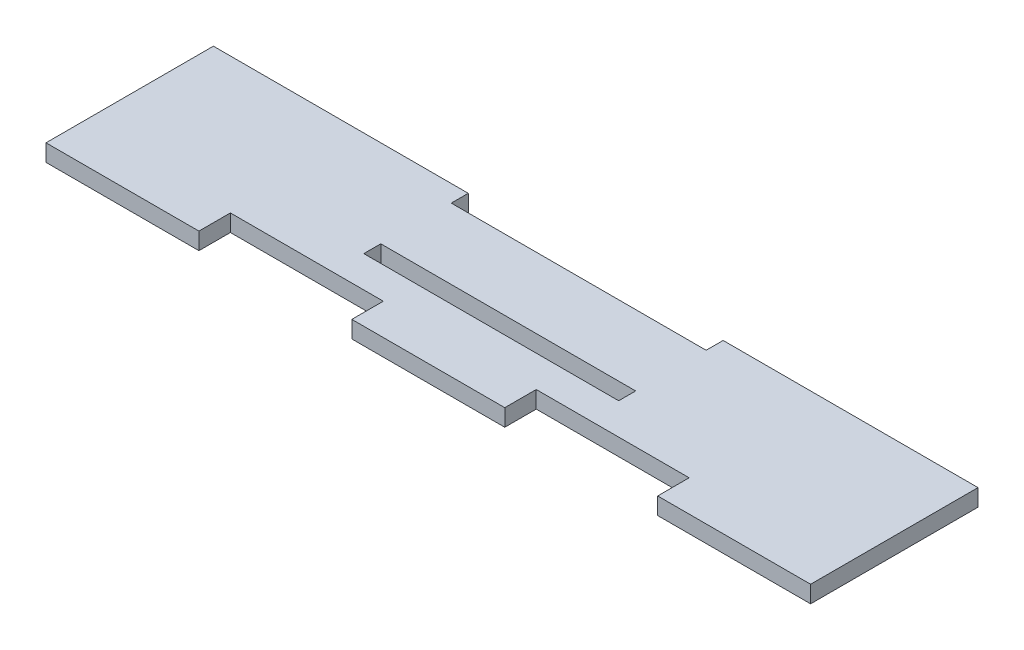
ISO-10303-21;
HEADER;
FILE_DESCRIPTION(('STEP AP214'),'2;1');
FILE_NAME('part.step','',(''),(''),'','','');
FILE_SCHEMA(('AUTOMOTIVE_DESIGN { 1 0 10303 214 1 1 1 1 }'));
ENDSEC;
DATA;
#1=APPLICATION_CONTEXT('core data for automotive mechanical design processes');
#2=APPLICATION_PROTOCOL_DEFINITION('international standard','automotive_design',2000,#1);
#3=PRODUCT_CONTEXT('',#1,'mechanical');
#4=PRODUCT('Part','Part','',(#3));
#5=PRODUCT_RELATED_PRODUCT_CATEGORY('part','',(#4));
#6=PRODUCT_DEFINITION_FORMATION('','',#4);
#7=PRODUCT_DEFINITION_CONTEXT('part definition',#1,'design');
#8=PRODUCT_DEFINITION('design','',#6,#7);
#9=PRODUCT_DEFINITION_SHAPE('','',#8);
#10=(LENGTH_UNIT() NAMED_UNIT(*) SI_UNIT(.MILLI.,.METRE.));
#11=(NAMED_UNIT(*) PLANE_ANGLE_UNIT() SI_UNIT($,.RADIAN.));
#12=(NAMED_UNIT(*) SI_UNIT($,.STERADIAN.) SOLID_ANGLE_UNIT());
#13=UNCERTAINTY_MEASURE_WITH_UNIT(LENGTH_MEASURE(1.E-05),#10,'distance_accuracy_value','');
#14=(GEOMETRIC_REPRESENTATION_CONTEXT(3) GLOBAL_UNCERTAINTY_ASSIGNED_CONTEXT((#13)) GLOBAL_UNIT_ASSIGNED_CONTEXT((#10,
#11,#12)) REPRESENTATION_CONTEXT('',''));
#15=CARTESIAN_POINT('',(0.,0.,0.));
#16=DIRECTION('',(0.,0.,1.));
#17=DIRECTION('',(1.,0.,0.));
#18=AXIS2_PLACEMENT_3D('',#15,#16,#17);
#19=CARTESIAN_POINT('',(0.,2.7,0.));
#20=DIRECTION('',(0.,-1.,0.));
#21=DIRECTION('',(0.,0.,-1.));
#22=AXIS2_PLACEMENT_3D('',#19,#20,#21);
#23=PLANE('',#22);
#24=DIRECTION('',(1.,0.,0.));
#25=VECTOR('',#24,1.);
#26=CARTESIAN_POINT('',(36.45,2.7,13.3));
#27=LINE('',#26,#25);
#28=CARTESIAN_POINT('',(36.45,2.7,13.3));
#29=VERTEX_POINT('',#28);
#30=CARTESIAN_POINT('',(60.75,2.7,13.3));
#31=VERTEX_POINT('',#30);
#32=EDGE_CURVE('E207',#29,#31,#27,.T.);
#33=ORIENTED_EDGE('',*,*,#32,.T.);
#34=DIRECTION('',(0.,0.,-1.));
#35=VECTOR('',#34,1.);
#36=CARTESIAN_POINT('',(60.75,2.7,-13.3));
#37=LINE('',#36,#35);
#38=CARTESIAN_POINT('',(60.75,2.7,-13.3));
#39=VERTEX_POINT('',#38);
#40=EDGE_CURVE('E210',#31,#39,#37,.T.);
#41=ORIENTED_EDGE('',*,*,#40,.T.);
#42=DIRECTION('',(-1.,0.,0.));
#43=VECTOR('',#42,1.);
#44=CARTESIAN_POINT('',(20.25,2.7,-13.3));
#45=LINE('',#44,#43);
#46=CARTESIAN_POINT('',(20.25,2.7,-13.3));
#47=VERTEX_POINT('',#46);
#48=EDGE_CURVE('E213',#39,#47,#45,.T.);
#49=ORIENTED_EDGE('',*,*,#48,.T.);
#50=DIRECTION('',(0.,0.,1.));
#51=VECTOR('',#50,1.);
#52=CARTESIAN_POINT('',(20.25,2.7,-13.3));
#53=LINE('',#52,#51);
#54=CARTESIAN_POINT('',(20.25,2.7,-10.6));
#55=VERTEX_POINT('',#54);
#56=EDGE_CURVE('E215',#47,#55,#53,.T.);
#57=ORIENTED_EDGE('',*,*,#56,.T.);
#58=DIRECTION('',(-1.,0.,0.));
#59=VECTOR('',#58,1.);
#60=CARTESIAN_POINT('',(-20.25,2.7,-10.6));
#61=LINE('',#60,#59);
#62=CARTESIAN_POINT('',(-20.25,2.7,-10.6));
#63=VERTEX_POINT('',#62);
#64=EDGE_CURVE('E217',#55,#63,#61,.T.);
#65=ORIENTED_EDGE('',*,*,#64,.T.);
#66=DIRECTION('',(0.,0.,-1.));
#67=VECTOR('',#66,1.);
#68=CARTESIAN_POINT('',(-20.25,2.7,-13.3));
#69=LINE('',#68,#67);
#70=CARTESIAN_POINT('',(-20.25,2.7,-13.3));
#71=VERTEX_POINT('',#70);
#72=EDGE_CURVE('E219',#63,#71,#69,.T.);
#73=ORIENTED_EDGE('',*,*,#72,.T.);
#74=DIRECTION('',(-1.,0.,0.));
#75=VECTOR('',#74,1.);
#76=CARTESIAN_POINT('',(-60.75,2.7,-13.3));
#77=LINE('',#76,#75);
#78=CARTESIAN_POINT('',(-60.75,2.7,-13.3));
#79=VERTEX_POINT('',#78);
#80=EDGE_CURVE('E221',#71,#79,#77,.T.);
#81=ORIENTED_EDGE('',*,*,#80,.T.);
#82=DIRECTION('',(0.,0.,1.));
#83=VECTOR('',#82,1.);
#84=CARTESIAN_POINT('',(-60.75,2.7,-13.3));
#85=LINE('',#84,#83);
#86=CARTESIAN_POINT('',(-60.75,2.7,13.3));
#87=VERTEX_POINT('',#86);
#88=EDGE_CURVE('E223',#79,#87,#85,.T.);
#89=ORIENTED_EDGE('',*,*,#88,.T.);
#90=DIRECTION('',(1.,0.,0.));
#91=VECTOR('',#90,1.);
#92=CARTESIAN_POINT('',(-60.75,2.7,13.3));
#93=LINE('',#92,#91);
#94=CARTESIAN_POINT('',(-36.45,2.7,13.3));
#95=VERTEX_POINT('',#94);
#96=EDGE_CURVE('E225',#87,#95,#93,.T.);
#97=ORIENTED_EDGE('',*,*,#96,.T.);
#98=DIRECTION('',(0.,0.,-1.));
#99=VECTOR('',#98,1.);
#100=CARTESIAN_POINT('',(-36.45,2.7,13.3));
#101=LINE('',#100,#99);
#102=CARTESIAN_POINT('',(-36.45,2.7,8.3));
#103=VERTEX_POINT('',#102);
#104=EDGE_CURVE('E227',#95,#103,#101,.T.);
#105=ORIENTED_EDGE('',*,*,#104,.T.);
#106=DIRECTION('',(1.,0.,0.));
#107=VECTOR('',#106,1.);
#108=CARTESIAN_POINT('',(-36.45,2.7,8.3));
#109=LINE('',#108,#107);
#110=CARTESIAN_POINT('',(-12.15,2.7,8.3));
#111=VERTEX_POINT('',#110);
#112=EDGE_CURVE('E229',#103,#111,#109,.T.);
#113=ORIENTED_EDGE('',*,*,#112,.T.);
#114=DIRECTION('',(0.,0.,1.));
#115=VECTOR('',#114,1.);
#116=CARTESIAN_POINT('',(-12.15,2.7,13.3));
#117=LINE('',#116,#115);
#118=CARTESIAN_POINT('',(-12.15,2.7,13.3));
#119=VERTEX_POINT('',#118);
#120=EDGE_CURVE('E231',#111,#119,#117,.T.);
#121=ORIENTED_EDGE('',*,*,#120,.T.);
#122=DIRECTION('',(1.,0.,0.));
#123=VECTOR('',#122,1.);
#124=CARTESIAN_POINT('',(-12.15,2.7,13.3));
#125=LINE('',#124,#123);
#126=CARTESIAN_POINT('',(12.15,2.7,13.3));
#127=VERTEX_POINT('',#126);
#128=EDGE_CURVE('E233',#119,#127,#125,.T.);
#129=ORIENTED_EDGE('',*,*,#128,.T.);
#130=DIRECTION('',(0.,0.,-1.));
#131=VECTOR('',#130,1.);
#132=CARTESIAN_POINT('',(12.15,2.7,13.3));
#133=LINE('',#132,#131);
#134=CARTESIAN_POINT('',(12.15,2.7,8.3));
#135=VERTEX_POINT('',#134);
#136=EDGE_CURVE('E235',#127,#135,#133,.T.);
#137=ORIENTED_EDGE('',*,*,#136,.T.);
#138=DIRECTION('',(1.,0.,0.));
#139=VECTOR('',#138,1.);
#140=CARTESIAN_POINT('',(12.15,2.7,8.3));
#141=LINE('',#140,#139);
#142=CARTESIAN_POINT('',(36.45,2.7,8.3));
#143=VERTEX_POINT('',#142);
#144=EDGE_CURVE('E237',#135,#143,#141,.T.);
#145=ORIENTED_EDGE('',*,*,#144,.T.);
#146=DIRECTION('',(0.,0.,1.));
#147=VECTOR('',#146,1.);
#148=CARTESIAN_POINT('',(36.45,2.7,13.3));
#149=LINE('',#148,#147);
#150=EDGE_CURVE('E239',#143,#29,#149,.T.);
#151=ORIENTED_EDGE('',*,*,#150,.T.);
#152=EDGE_LOOP('',(#33,#41,#49,#57,#65,#73,#81,#89,#97,#105,#113,#121,#129,#137,#145,#151));
#153=FACE_BOUND('',#152,.T.);
#154=DIRECTION('',(0.,0.,1.));
#155=VECTOR('',#154,1.);
#156=CARTESIAN_POINT('',(-20.25,2.7,0.600000000000001));
#157=LINE('',#156,#155);
#158=CARTESIAN_POINT('',(-20.25,2.7,0.600000000000001));
#159=VERTEX_POINT('',#158);
#160=CARTESIAN_POINT('',(-20.25,2.7,3.3));
#161=VERTEX_POINT('',#160);
#162=EDGE_CURVE('E171',#159,#161,#157,.T.);
#163=ORIENTED_EDGE('',*,*,#162,.F.);
#164=DIRECTION('',(-1.,0.,0.));
#165=VECTOR('',#164,1.);
#166=CARTESIAN_POINT('',(-20.25,2.7,0.600000000000001));
#167=LINE('',#166,#165);
#168=CARTESIAN_POINT('',(20.25,2.7,0.600000000000001));
#169=VERTEX_POINT('',#168);
#170=EDGE_CURVE('E193',#169,#159,#167,.T.);
#171=ORIENTED_EDGE('',*,*,#170,.F.);
#172=DIRECTION('',(0.,0.,-1.));
#173=VECTOR('',#172,1.);
#174=CARTESIAN_POINT('',(20.25,2.7,0.600000000000001));
#175=LINE('',#174,#173);
#176=CARTESIAN_POINT('',(20.25,2.7,3.3));
#177=VERTEX_POINT('',#176);
#178=EDGE_CURVE('E191',#177,#169,#175,.T.);
#179=ORIENTED_EDGE('',*,*,#178,.F.);
#180=DIRECTION('',(1.,0.,0.));
#181=VECTOR('',#180,1.);
#182=CARTESIAN_POINT('',(-20.25,2.7,3.3));
#183=LINE('',#182,#181);
#184=EDGE_CURVE('E179',#161,#177,#183,.T.);
#185=ORIENTED_EDGE('',*,*,#184,.F.);
#186=EDGE_LOOP('',(#163,#171,#179,#185));
#187=FACE_BOUND('',#186,.T.);
#188=ADVANCED_FACE('F34',(#153,#187),#23,.F.);
#189=CARTESIAN_POINT('',(0.,0.,0.));
#190=DIRECTION('',(0.,-1.,0.));
#191=DIRECTION('',(0.,0.,-1.));
#192=AXIS2_PLACEMENT_3D('',#189,#190,#191);
#193=PLANE('',#192);
#194=DIRECTION('',(1.,0.,0.));
#195=VECTOR('',#194,1.);
#196=CARTESIAN_POINT('',(36.45,0.,13.3));
#197=LINE('',#196,#195);
#198=CARTESIAN_POINT('',(36.45,0.,13.3));
#199=VERTEX_POINT('',#198);
#200=CARTESIAN_POINT('',(60.75,0.,13.3));
#201=VERTEX_POINT('',#200);
#202=EDGE_CURVE('E187',#199,#201,#197,.T.);
#203=ORIENTED_EDGE('',*,*,#202,.F.);
#204=DIRECTION('',(0.,0.,1.));
#205=VECTOR('',#204,1.);
#206=CARTESIAN_POINT('',(36.45,0.,13.3));
#207=LINE('',#206,#205);
#208=CARTESIAN_POINT('',(36.45,0.,8.3));
#209=VERTEX_POINT('',#208);
#210=EDGE_CURVE('E211',#209,#199,#207,.T.);
#211=ORIENTED_EDGE('',*,*,#210,.F.);
#212=DIRECTION('',(1.,0.,0.));
#213=VECTOR('',#212,1.);
#214=CARTESIAN_POINT('',(12.15,0.,8.3));
#215=LINE('',#214,#213);
#216=CARTESIAN_POINT('',(12.15,0.,8.3));
#217=VERTEX_POINT('',#216);
#218=EDGE_CURVE('E270',#217,#209,#215,.T.);
#219=ORIENTED_EDGE('',*,*,#218,.F.);
#220=DIRECTION('',(0.,0.,-1.));
#221=VECTOR('',#220,1.);
#222=CARTESIAN_POINT('',(12.15,0.,13.3));
#223=LINE('',#222,#221);
#224=CARTESIAN_POINT('',(12.15,0.,13.3));
#225=VERTEX_POINT('',#224);
#226=EDGE_CURVE('E268',#225,#217,#223,.T.);
#227=ORIENTED_EDGE('',*,*,#226,.F.);
#228=DIRECTION('',(1.,0.,0.));
#229=VECTOR('',#228,1.);
#230=CARTESIAN_POINT('',(-12.15,0.,13.3));
#231=LINE('',#230,#229);
#232=CARTESIAN_POINT('',(-12.15,0.,13.3));
#233=VERTEX_POINT('',#232);
#234=EDGE_CURVE('E266',#233,#225,#231,.T.);
#235=ORIENTED_EDGE('',*,*,#234,.F.);
#236=DIRECTION('',(0.,0.,1.));
#237=VECTOR('',#236,1.);
#238=CARTESIAN_POINT('',(-12.15,0.,13.3));
#239=LINE('',#238,#237);
#240=CARTESIAN_POINT('',(-12.15,0.,8.3));
#241=VERTEX_POINT('',#240);
#242=EDGE_CURVE('E264',#241,#233,#239,.T.);
#243=ORIENTED_EDGE('',*,*,#242,.F.);
#244=DIRECTION('',(1.,0.,0.));
#245=VECTOR('',#244,1.);
#246=CARTESIAN_POINT('',(-36.45,0.,8.3));
#247=LINE('',#246,#245);
#248=CARTESIAN_POINT('',(-36.45,0.,8.3));
#249=VERTEX_POINT('',#248);
#250=EDGE_CURVE('E262',#249,#241,#247,.T.);
#251=ORIENTED_EDGE('',*,*,#250,.F.);
#252=DIRECTION('',(0.,0.,-1.));
#253=VECTOR('',#252,1.);
#254=CARTESIAN_POINT('',(-36.45,0.,13.3));
#255=LINE('',#254,#253);
#256=CARTESIAN_POINT('',(-36.45,0.,13.3));
#257=VERTEX_POINT('',#256);
#258=EDGE_CURVE('E260',#257,#249,#255,.T.);
#259=ORIENTED_EDGE('',*,*,#258,.F.);
#260=DIRECTION('',(1.,0.,0.));
#261=VECTOR('',#260,1.);
#262=CARTESIAN_POINT('',(-60.75,0.,13.3));
#263=LINE('',#262,#261);
#264=CARTESIAN_POINT('',(-60.75,0.,13.3));
#265=VERTEX_POINT('',#264);
#266=EDGE_CURVE('E258',#265,#257,#263,.T.);
#267=ORIENTED_EDGE('',*,*,#266,.F.);
#268=DIRECTION('',(0.,0.,1.));
#269=VECTOR('',#268,1.);
#270=CARTESIAN_POINT('',(-60.75,0.,-13.3));
#271=LINE('',#270,#269);
#272=CARTESIAN_POINT('',(-60.75,0.,-13.3));
#273=VERTEX_POINT('',#272);
#274=EDGE_CURVE('E256',#273,#265,#271,.T.);
#275=ORIENTED_EDGE('',*,*,#274,.F.);
#276=DIRECTION('',(-1.,0.,0.));
#277=VECTOR('',#276,1.);
#278=CARTESIAN_POINT('',(-60.75,0.,-13.3));
#279=LINE('',#278,#277);
#280=CARTESIAN_POINT('',(-20.25,0.,-13.3));
#281=VERTEX_POINT('',#280);
#282=EDGE_CURVE('E254',#281,#273,#279,.T.);
#283=ORIENTED_EDGE('',*,*,#282,.F.);
#284=DIRECTION('',(0.,0.,-1.));
#285=VECTOR('',#284,1.);
#286=CARTESIAN_POINT('',(-20.25,0.,-13.3));
#287=LINE('',#286,#285);
#288=CARTESIAN_POINT('',(-20.25,0.,-10.6));
#289=VERTEX_POINT('',#288);
#290=EDGE_CURVE('E252',#289,#281,#287,.T.);
#291=ORIENTED_EDGE('',*,*,#290,.F.);
#292=DIRECTION('',(-1.,0.,0.));
#293=VECTOR('',#292,1.);
#294=CARTESIAN_POINT('',(-20.25,0.,-10.6));
#295=LINE('',#294,#293);
#296=CARTESIAN_POINT('',(20.25,0.,-10.6));
#297=VERTEX_POINT('',#296);
#298=EDGE_CURVE('E250',#297,#289,#295,.T.);
#299=ORIENTED_EDGE('',*,*,#298,.F.);
#300=DIRECTION('',(0.,0.,1.));
#301=VECTOR('',#300,1.);
#302=CARTESIAN_POINT('',(20.25,0.,-13.3));
#303=LINE('',#302,#301);
#304=CARTESIAN_POINT('',(20.25,0.,-13.3));
#305=VERTEX_POINT('',#304);
#306=EDGE_CURVE('E248',#305,#297,#303,.T.);
#307=ORIENTED_EDGE('',*,*,#306,.F.);
#308=DIRECTION('',(-1.,0.,0.));
#309=VECTOR('',#308,1.);
#310=CARTESIAN_POINT('',(20.25,0.,-13.3));
#311=LINE('',#310,#309);
#312=CARTESIAN_POINT('',(60.75,0.,-13.3));
#313=VERTEX_POINT('',#312);
#314=EDGE_CURVE('E246',#313,#305,#311,.T.);
#315=ORIENTED_EDGE('',*,*,#314,.F.);
#316=DIRECTION('',(0.,0.,-1.));
#317=VECTOR('',#316,1.);
#318=CARTESIAN_POINT('',(60.75,0.,-13.3));
#319=LINE('',#318,#317);
#320=EDGE_CURVE('E244',#201,#313,#319,.T.);
#321=ORIENTED_EDGE('',*,*,#320,.F.);
#322=EDGE_LOOP('',(#203,#211,#219,#227,#235,#243,#251,#259,#267,#275,#283,#291,#299,#307,#315,#321));
#323=FACE_BOUND('',#322,.T.);
#324=DIRECTION('',(-1.,0.,0.));
#325=VECTOR('',#324,1.);
#326=CARTESIAN_POINT('',(-20.25,0.,0.600000000000001));
#327=LINE('',#326,#325);
#328=CARTESIAN_POINT('',(20.25,0.,0.600000000000001));
#329=VERTEX_POINT('',#328);
#330=CARTESIAN_POINT('',(-20.25,0.,0.600000000000001));
#331=VERTEX_POINT('',#330);
#332=EDGE_CURVE('E180',#329,#331,#327,.T.);
#333=ORIENTED_EDGE('',*,*,#332,.T.);
#334=DIRECTION('',(0.,0.,1.));
#335=VECTOR('',#334,1.);
#336=CARTESIAN_POINT('',(-20.25,0.,0.600000000000001));
#337=LINE('',#336,#335);
#338=CARTESIAN_POINT('',(-20.25,0.,3.3));
#339=VERTEX_POINT('',#338);
#340=EDGE_CURVE('E57',#331,#339,#337,.T.);
#341=ORIENTED_EDGE('',*,*,#340,.T.);
#342=DIRECTION('',(1.,0.,0.));
#343=VECTOR('',#342,1.);
#344=CARTESIAN_POINT('',(-20.25,0.,3.3));
#345=LINE('',#344,#343);
#346=CARTESIAN_POINT('',(20.25,0.,3.3));
#347=VERTEX_POINT('',#346);
#348=EDGE_CURVE('E186',#339,#347,#345,.T.);
#349=ORIENTED_EDGE('',*,*,#348,.T.);
#350=DIRECTION('',(0.,0.,-1.));
#351=VECTOR('',#350,1.);
#352=CARTESIAN_POINT('',(20.25,0.,0.600000000000001));
#353=LINE('',#352,#351);
#354=EDGE_CURVE('E199',#347,#329,#353,.T.);
#355=ORIENTED_EDGE('',*,*,#354,.T.);
#356=EDGE_LOOP('',(#333,#341,#349,#355));
#357=FACE_BOUND('',#356,.T.);
#358=ADVANCED_FACE('F324',(#323,#357),#193,.T.);
#359=CARTESIAN_POINT('',(36.45,2.7,13.3));
#360=DIRECTION('',(0.,0.,-1.));
#361=DIRECTION('',(-1.,0.,0.));
#362=AXIS2_PLACEMENT_3D('',#359,#360,#361);
#363=PLANE('',#362);
#364=ORIENTED_EDGE('',*,*,#202,.T.);
#365=DIRECTION('',(0.,-1.,0.));
#366=VECTOR('',#365,1.);
#367=CARTESIAN_POINT('',(60.75,2.7,13.3));
#368=LINE('',#367,#366);
#369=EDGE_CURVE('E11',#31,#201,#368,.T.);
#370=ORIENTED_EDGE('',*,*,#369,.F.);
#371=ORIENTED_EDGE('',*,*,#32,.F.);
#372=DIRECTION('',(0.,-1.,0.));
#373=VECTOR('',#372,1.);
#374=CARTESIAN_POINT('',(36.45,2.7,13.3));
#375=LINE('',#374,#373);
#376=EDGE_CURVE('E241',#29,#199,#375,.T.);
#377=ORIENTED_EDGE('',*,*,#376,.T.);
#378=EDGE_LOOP('',(#364,#370,#371,#377));
#379=FACE_BOUND('',#378,.T.);
#380=ADVANCED_FACE('F36',(#379),#363,.F.);
#381=CARTESIAN_POINT('',(60.75,2.7,-13.3));
#382=DIRECTION('',(-1.,0.,0.));
#383=DIRECTION('',(0.,0.,1.));
#384=AXIS2_PLACEMENT_3D('',#381,#382,#383);
#385=PLANE('',#384);
#386=ORIENTED_EDGE('',*,*,#320,.T.);
#387=DIRECTION('',(0.,-1.,0.));
#388=VECTOR('',#387,1.);
#389=CARTESIAN_POINT('',(60.75,2.7,-13.3));
#390=LINE('',#389,#388);
#391=EDGE_CURVE('E42',#39,#313,#390,.T.);
#392=ORIENTED_EDGE('',*,*,#391,.F.);
#393=ORIENTED_EDGE('',*,*,#40,.F.);
#394=ORIENTED_EDGE('',*,*,#369,.T.);
#395=EDGE_LOOP('',(#386,#392,#393,#394));
#396=FACE_BOUND('',#395,.T.);
#397=ADVANCED_FACE('F341',(#396),#385,.F.);
#398=CARTESIAN_POINT('',(20.25,2.7,-13.3));
#399=DIRECTION('',(0.,0.,1.));
#400=DIRECTION('',(1.,0.,0.));
#401=AXIS2_PLACEMENT_3D('',#398,#399,#400);
#402=PLANE('',#401);
#403=ORIENTED_EDGE('',*,*,#314,.T.);
#404=DIRECTION('',(0.,-1.,0.));
#405=VECTOR('',#404,1.);
#406=CARTESIAN_POINT('',(20.25,2.7,-13.3));
#407=LINE('',#406,#405);
#408=EDGE_CURVE('E311',#47,#305,#407,.T.);
#409=ORIENTED_EDGE('',*,*,#408,.F.);
#410=ORIENTED_EDGE('',*,*,#48,.F.);
#411=ORIENTED_EDGE('',*,*,#391,.T.);
#412=EDGE_LOOP('',(#403,#409,#410,#411));
#413=FACE_BOUND('',#412,.T.);
#414=ADVANCED_FACE('F318',(#413),#402,.F.);
#415=CARTESIAN_POINT('',(20.25,2.7,-13.3));
#416=DIRECTION('',(1.,0.,0.));
#417=DIRECTION('',(0.,0.,-1.));
#418=AXIS2_PLACEMENT_3D('',#415,#416,#417);
#419=PLANE('',#418);
#420=ORIENTED_EDGE('',*,*,#306,.T.);
#421=DIRECTION('',(0.,-1.,0.));
#422=VECTOR('',#421,1.);
#423=CARTESIAN_POINT('',(20.25,2.7,-10.6));
#424=LINE('',#423,#422);
#425=EDGE_CURVE('E308',#55,#297,#424,.T.);
#426=ORIENTED_EDGE('',*,*,#425,.F.);
#427=ORIENTED_EDGE('',*,*,#56,.F.);
#428=ORIENTED_EDGE('',*,*,#408,.T.);
#429=EDGE_LOOP('',(#420,#426,#427,#428));
#430=FACE_BOUND('',#429,.T.);
#431=ADVANCED_FACE('F330',(#430),#419,.F.);
#432=CARTESIAN_POINT('',(-20.25,2.7,-10.6));
#433=DIRECTION('',(0.,0.,1.));
#434=DIRECTION('',(1.,0.,0.));
#435=AXIS2_PLACEMENT_3D('',#432,#433,#434);
#436=PLANE('',#435);
#437=ORIENTED_EDGE('',*,*,#298,.T.);
#438=DIRECTION('',(0.,-1.,0.));
#439=VECTOR('',#438,1.);
#440=CARTESIAN_POINT('',(-20.25,2.7,-10.6));
#441=LINE('',#440,#439);
#442=EDGE_CURVE('E305',#63,#289,#441,.T.);
#443=ORIENTED_EDGE('',*,*,#442,.F.);
#444=ORIENTED_EDGE('',*,*,#64,.F.);
#445=ORIENTED_EDGE('',*,*,#425,.T.);
#446=EDGE_LOOP('',(#437,#443,#444,#445));
#447=FACE_BOUND('',#446,.T.);
#448=ADVANCED_FACE('F334',(#447),#436,.F.);
#449=CARTESIAN_POINT('',(-20.25,2.7,-13.3));
#450=DIRECTION('',(-1.,0.,0.));
#451=DIRECTION('',(0.,0.,1.));
#452=AXIS2_PLACEMENT_3D('',#449,#450,#451);
#453=PLANE('',#452);
#454=ORIENTED_EDGE('',*,*,#290,.T.);
#455=DIRECTION('',(0.,-1.,0.));
#456=VECTOR('',#455,1.);
#457=CARTESIAN_POINT('',(-20.25,2.7,-13.3));
#458=LINE('',#457,#456);
#459=EDGE_CURVE('E302',#71,#281,#458,.T.);
#460=ORIENTED_EDGE('',*,*,#459,.F.);
#461=ORIENTED_EDGE('',*,*,#72,.F.);
#462=ORIENTED_EDGE('',*,*,#442,.T.);
#463=EDGE_LOOP('',(#454,#460,#461,#462));
#464=FACE_BOUND('',#463,.T.);
#465=ADVANCED_FACE('F394',(#464),#453,.F.);
#466=CARTESIAN_POINT('',(-60.75,2.7,-13.3));
#467=DIRECTION('',(0.,0.,1.));
#468=DIRECTION('',(1.,0.,0.));
#469=AXIS2_PLACEMENT_3D('',#466,#467,#468);
#470=PLANE('',#469);
#471=ORIENTED_EDGE('',*,*,#282,.T.);
#472=DIRECTION('',(0.,-1.,0.));
#473=VECTOR('',#472,1.);
#474=CARTESIAN_POINT('',(-60.75,2.7,-13.3));
#475=LINE('',#474,#473);
#476=EDGE_CURVE('E299',#79,#273,#475,.T.);
#477=ORIENTED_EDGE('',*,*,#476,.F.);
#478=ORIENTED_EDGE('',*,*,#80,.F.);
#479=ORIENTED_EDGE('',*,*,#459,.T.);
#480=EDGE_LOOP('',(#471,#477,#478,#479));
#481=FACE_BOUND('',#480,.T.);
#482=ADVANCED_FACE('F391',(#481),#470,.F.);
#483=CARTESIAN_POINT('',(-60.75,2.7,-13.3));
#484=DIRECTION('',(1.,0.,0.));
#485=DIRECTION('',(0.,0.,-1.));
#486=AXIS2_PLACEMENT_3D('',#483,#484,#485);
#487=PLANE('',#486);
#488=ORIENTED_EDGE('',*,*,#274,.T.);
#489=DIRECTION('',(0.,-1.,0.));
#490=VECTOR('',#489,1.);
#491=CARTESIAN_POINT('',(-60.75,2.7,13.3));
#492=LINE('',#491,#490);
#493=EDGE_CURVE('E296',#87,#265,#492,.T.);
#494=ORIENTED_EDGE('',*,*,#493,.F.);
#495=ORIENTED_EDGE('',*,*,#88,.F.);
#496=ORIENTED_EDGE('',*,*,#476,.T.);
#497=EDGE_LOOP('',(#488,#494,#495,#496));
#498=FACE_BOUND('',#497,.T.);
#499=ADVANCED_FACE('F387',(#498),#487,.F.);
#500=CARTESIAN_POINT('',(-60.75,2.7,13.3));
#501=DIRECTION('',(0.,0.,-1.));
#502=DIRECTION('',(-1.,0.,0.));
#503=AXIS2_PLACEMENT_3D('',#500,#501,#502);
#504=PLANE('',#503);
#505=ORIENTED_EDGE('',*,*,#266,.T.);
#506=DIRECTION('',(0.,-1.,0.));
#507=VECTOR('',#506,1.);
#508=CARTESIAN_POINT('',(-36.45,2.7,13.3));
#509=LINE('',#508,#507);
#510=EDGE_CURVE('E293',#95,#257,#509,.T.);
#511=ORIENTED_EDGE('',*,*,#510,.F.);
#512=ORIENTED_EDGE('',*,*,#96,.F.);
#513=ORIENTED_EDGE('',*,*,#493,.T.);
#514=EDGE_LOOP('',(#505,#511,#512,#513));
#515=FACE_BOUND('',#514,.T.);
#516=ADVANCED_FACE('F383',(#515),#504,.F.);
#517=CARTESIAN_POINT('',(-36.45,2.7,13.3));
#518=DIRECTION('',(-1.,0.,0.));
#519=DIRECTION('',(0.,0.,1.));
#520=AXIS2_PLACEMENT_3D('',#517,#518,#519);
#521=PLANE('',#520);
#522=ORIENTED_EDGE('',*,*,#258,.T.);
#523=DIRECTION('',(0.,-1.,0.));
#524=VECTOR('',#523,1.);
#525=CARTESIAN_POINT('',(-36.45,2.7,8.3));
#526=LINE('',#525,#524);
#527=EDGE_CURVE('E290',#103,#249,#526,.T.);
#528=ORIENTED_EDGE('',*,*,#527,.F.);
#529=ORIENTED_EDGE('',*,*,#104,.F.);
#530=ORIENTED_EDGE('',*,*,#510,.T.);
#531=EDGE_LOOP('',(#522,#528,#529,#530));
#532=FACE_BOUND('',#531,.T.);
#533=ADVANCED_FACE('F378',(#532),#521,.F.);
#534=CARTESIAN_POINT('',(-36.45,2.7,8.3));
#535=DIRECTION('',(0.,0.,-1.));
#536=DIRECTION('',(-1.,0.,0.));
#537=AXIS2_PLACEMENT_3D('',#534,#535,#536);
#538=PLANE('',#537);
#539=ORIENTED_EDGE('',*,*,#250,.T.);
#540=DIRECTION('',(0.,-1.,0.));
#541=VECTOR('',#540,1.);
#542=CARTESIAN_POINT('',(-12.15,2.7,8.3));
#543=LINE('',#542,#541);
#544=EDGE_CURVE('E287',#111,#241,#543,.T.);
#545=ORIENTED_EDGE('',*,*,#544,.F.);
#546=ORIENTED_EDGE('',*,*,#112,.F.);
#547=ORIENTED_EDGE('',*,*,#527,.T.);
#548=EDGE_LOOP('',(#539,#545,#546,#547));
#549=FACE_BOUND('',#548,.T.);
#550=ADVANCED_FACE('F372',(#549),#538,.F.);
#551=CARTESIAN_POINT('',(-12.15,2.7,13.3));
#552=DIRECTION('',(1.,0.,0.));
#553=DIRECTION('',(0.,0.,-1.));
#554=AXIS2_PLACEMENT_3D('',#551,#552,#553);
#555=PLANE('',#554);
#556=ORIENTED_EDGE('',*,*,#242,.T.);
#557=DIRECTION('',(0.,-1.,0.));
#558=VECTOR('',#557,1.);
#559=CARTESIAN_POINT('',(-12.15,2.7,13.3));
#560=LINE('',#559,#558);
#561=EDGE_CURVE('E284',#119,#233,#560,.T.);
#562=ORIENTED_EDGE('',*,*,#561,.F.);
#563=ORIENTED_EDGE('',*,*,#120,.F.);
#564=ORIENTED_EDGE('',*,*,#544,.T.);
#565=EDGE_LOOP('',(#556,#562,#563,#564));
#566=FACE_BOUND('',#565,.T.);
#567=ADVANCED_FACE('F368',(#566),#555,.F.);
#568=CARTESIAN_POINT('',(-12.15,2.7,13.3));
#569=DIRECTION('',(0.,0.,-1.));
#570=DIRECTION('',(-1.,0.,0.));
#571=AXIS2_PLACEMENT_3D('',#568,#569,#570);
#572=PLANE('',#571);
#573=ORIENTED_EDGE('',*,*,#234,.T.);
#574=DIRECTION('',(0.,-1.,0.));
#575=VECTOR('',#574,1.);
#576=CARTESIAN_POINT('',(12.15,2.7,13.3));
#577=LINE('',#576,#575);
#578=EDGE_CURVE('E281',#127,#225,#577,.T.);
#579=ORIENTED_EDGE('',*,*,#578,.F.);
#580=ORIENTED_EDGE('',*,*,#128,.F.);
#581=ORIENTED_EDGE('',*,*,#561,.T.);
#582=EDGE_LOOP('',(#573,#579,#580,#581));
#583=FACE_BOUND('',#582,.T.);
#584=ADVANCED_FACE('F363',(#583),#572,.F.);
#585=CARTESIAN_POINT('',(12.15,2.7,13.3));
#586=DIRECTION('',(-1.,0.,0.));
#587=DIRECTION('',(0.,0.,1.));
#588=AXIS2_PLACEMENT_3D('',#585,#586,#587);
#589=PLANE('',#588);
#590=ORIENTED_EDGE('',*,*,#226,.T.);
#591=DIRECTION('',(0.,-1.,0.));
#592=VECTOR('',#591,1.);
#593=CARTESIAN_POINT('',(12.15,2.7,8.3));
#594=LINE('',#593,#592);
#595=EDGE_CURVE('E278',#135,#217,#594,.T.);
#596=ORIENTED_EDGE('',*,*,#595,.F.);
#597=ORIENTED_EDGE('',*,*,#136,.F.);
#598=ORIENTED_EDGE('',*,*,#578,.T.);
#599=EDGE_LOOP('',(#590,#596,#597,#598));
#600=FACE_BOUND('',#599,.T.);
#601=ADVANCED_FACE('F357',(#600),#589,.F.);
#602=CARTESIAN_POINT('',(12.15,2.7,8.3));
#603=DIRECTION('',(0.,0.,-1.));
#604=DIRECTION('',(-1.,0.,0.));
#605=AXIS2_PLACEMENT_3D('',#602,#603,#604);
#606=PLANE('',#605);
#607=ORIENTED_EDGE('',*,*,#218,.T.);
#608=DIRECTION('',(0.,-1.,0.));
#609=VECTOR('',#608,1.);
#610=CARTESIAN_POINT('',(36.45,2.7,8.3));
#611=LINE('',#610,#609);
#612=EDGE_CURVE('E275',#143,#209,#611,.T.);
#613=ORIENTED_EDGE('',*,*,#612,.F.);
#614=ORIENTED_EDGE('',*,*,#144,.F.);
#615=ORIENTED_EDGE('',*,*,#595,.T.);
#616=EDGE_LOOP('',(#607,#613,#614,#615));
#617=FACE_BOUND('',#616,.T.);
#618=ADVANCED_FACE('F353',(#617),#606,.F.);
#619=CARTESIAN_POINT('',(36.45,2.7,13.3));
#620=DIRECTION('',(1.,0.,0.));
#621=DIRECTION('',(0.,0.,-1.));
#622=AXIS2_PLACEMENT_3D('',#619,#620,#621);
#623=PLANE('',#622);
#624=ORIENTED_EDGE('',*,*,#210,.T.);
#625=ORIENTED_EDGE('',*,*,#376,.F.);
#626=ORIENTED_EDGE('',*,*,#150,.F.);
#627=ORIENTED_EDGE('',*,*,#612,.T.);
#628=EDGE_LOOP('',(#624,#625,#626,#627));
#629=FACE_BOUND('',#628,.T.);
#630=ADVANCED_FACE('F348',(#629),#623,.F.);
#631=CARTESIAN_POINT('',(-20.25,2.7,0.600000000000001));
#632=DIRECTION('',(1.,0.,0.));
#633=DIRECTION('',(0.,0.,-1.));
#634=AXIS2_PLACEMENT_3D('',#631,#632,#633);
#635=PLANE('',#634);
#636=ORIENTED_EDGE('',*,*,#340,.F.);
#637=DIRECTION('',(0.,-1.,0.));
#638=VECTOR('',#637,1.);
#639=CARTESIAN_POINT('',(-20.25,2.7,0.600000000000001));
#640=LINE('',#639,#638);
#641=EDGE_CURVE('E175',#159,#331,#640,.T.);
#642=ORIENTED_EDGE('',*,*,#641,.F.);
#643=ORIENTED_EDGE('',*,*,#162,.T.);
#644=DIRECTION('',(0.,-1.,0.));
#645=VECTOR('',#644,1.);
#646=CARTESIAN_POINT('',(-20.25,2.7,3.3));
#647=LINE('',#646,#645);
#648=EDGE_CURVE('E174',#161,#339,#647,.T.);
#649=ORIENTED_EDGE('',*,*,#648,.T.);
#650=EDGE_LOOP('',(#636,#642,#643,#649));
#651=FACE_BOUND('',#650,.T.);
#652=ADVANCED_FACE('F173',(#651),#635,.T.);
#653=CARTESIAN_POINT('',(-20.25,2.7,3.3));
#654=DIRECTION('',(0.,0.,-1.));
#655=DIRECTION('',(-1.,0.,0.));
#656=AXIS2_PLACEMENT_3D('',#653,#654,#655);
#657=PLANE('',#656);
#658=ORIENTED_EDGE('',*,*,#348,.F.);
#659=ORIENTED_EDGE('',*,*,#648,.F.);
#660=ORIENTED_EDGE('',*,*,#184,.T.);
#661=DIRECTION('',(0.,-1.,0.));
#662=VECTOR('',#661,1.);
#663=CARTESIAN_POINT('',(20.25,2.7,3.3));
#664=LINE('',#663,#662);
#665=EDGE_CURVE('E188',#177,#347,#664,.T.);
#666=ORIENTED_EDGE('',*,*,#665,.T.);
#667=EDGE_LOOP('',(#658,#659,#660,#666));
#668=FACE_BOUND('',#667,.T.);
#669=ADVANCED_FACE('F183',(#668),#657,.T.);
#670=CARTESIAN_POINT('',(20.25,2.7,0.600000000000001));
#671=DIRECTION('',(-1.,0.,0.));
#672=DIRECTION('',(0.,0.,1.));
#673=AXIS2_PLACEMENT_3D('',#670,#671,#672);
#674=PLANE('',#673);
#675=ORIENTED_EDGE('',*,*,#354,.F.);
#676=ORIENTED_EDGE('',*,*,#665,.F.);
#677=ORIENTED_EDGE('',*,*,#178,.T.);
#678=DIRECTION('',(0.,-1.,0.));
#679=VECTOR('',#678,1.);
#680=CARTESIAN_POINT('',(20.25,2.7,0.600000000000001));
#681=LINE('',#680,#679);
#682=EDGE_CURVE('E49',#169,#329,#681,.T.);
#683=ORIENTED_EDGE('',*,*,#682,.T.);
#684=EDGE_LOOP('',(#675,#676,#677,#683));
#685=FACE_BOUND('',#684,.T.);
#686=ADVANCED_FACE('F476',(#685),#674,.T.);
#687=CARTESIAN_POINT('',(-20.25,2.7,0.600000000000001));
#688=DIRECTION('',(0.,0.,1.));
#689=DIRECTION('',(1.,0.,0.));
#690=AXIS2_PLACEMENT_3D('',#687,#688,#689);
#691=PLANE('',#690);
#692=ORIENTED_EDGE('',*,*,#332,.F.);
#693=ORIENTED_EDGE('',*,*,#682,.F.);
#694=ORIENTED_EDGE('',*,*,#170,.T.);
#695=ORIENTED_EDGE('',*,*,#641,.T.);
#696=EDGE_LOOP('',(#692,#693,#694,#695));
#697=FACE_BOUND('',#696,.T.);
#698=ADVANCED_FACE('F482',(#697),#691,.T.);
#699=CLOSED_SHELL('',(#188,#358,#380,#397,#414,#431,#448,#465,#482,#499,#516,#533,#550,#567,
#584,#601,#618,#630,#652,#669,#686,#698));
#700=MANIFOLD_SOLID_BREP('B2',#699);
#701=ADVANCED_BREP_SHAPE_REPRESENTATION('',(#18,#700),#14);
#702=SHAPE_DEFINITION_REPRESENTATION(#9,#701);
ENDSEC;
END-ISO-10303-21;
